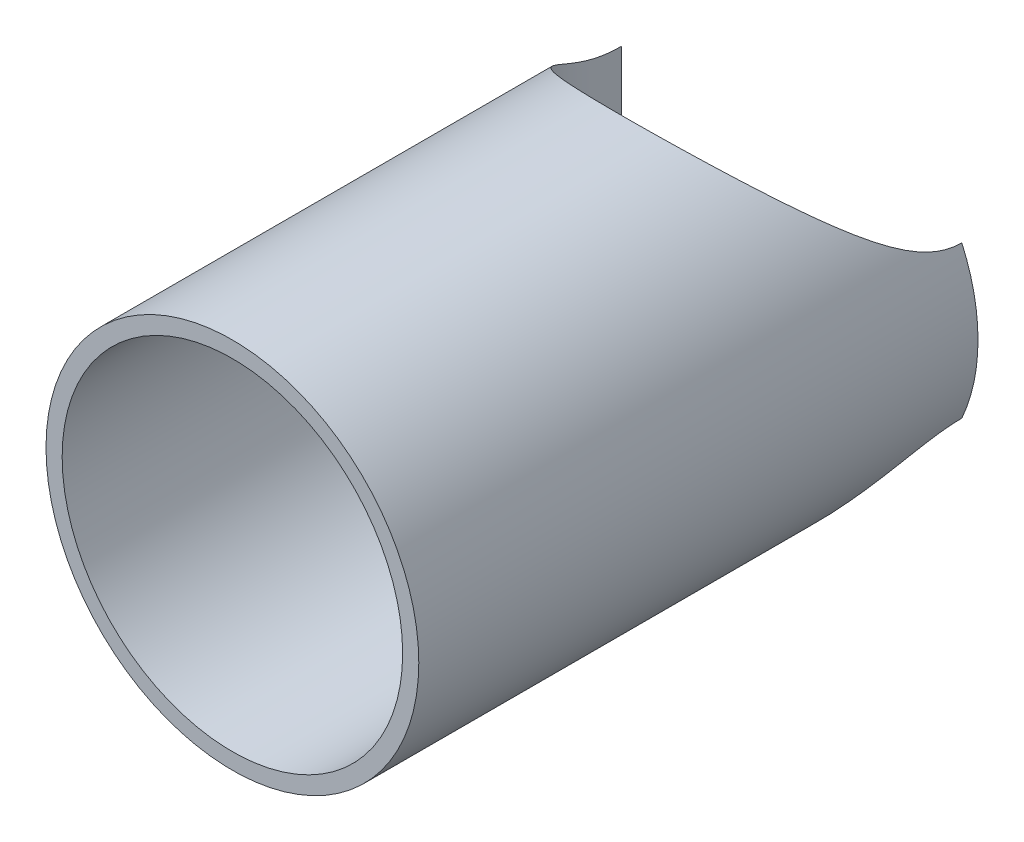
ISO-10303-21;
HEADER;
FILE_DESCRIPTION(('STEP AP214'),'2;1');
FILE_NAME('part.step','',(''),(''),'','','');
FILE_SCHEMA(('AUTOMOTIVE_DESIGN { 1 0 10303 214 1 1 1 1 }'));
ENDSEC;
DATA;
#1=APPLICATION_CONTEXT('core data for automotive mechanical design processes');
#2=APPLICATION_PROTOCOL_DEFINITION('international standard','automotive_design',2000,#1);
#3=PRODUCT_CONTEXT('',#1,'mechanical');
#4=PRODUCT('Part','Part','',(#3));
#5=PRODUCT_RELATED_PRODUCT_CATEGORY('part','',(#4));
#6=PRODUCT_DEFINITION_FORMATION('','',#4);
#7=PRODUCT_DEFINITION_CONTEXT('part definition',#1,'design');
#8=PRODUCT_DEFINITION('design','',#6,#7);
#9=PRODUCT_DEFINITION_SHAPE('','',#8);
#10=(LENGTH_UNIT() NAMED_UNIT(*) SI_UNIT(.MILLI.,.METRE.));
#11=(NAMED_UNIT(*) PLANE_ANGLE_UNIT() SI_UNIT($,.RADIAN.));
#12=(NAMED_UNIT(*) SI_UNIT($,.STERADIAN.) SOLID_ANGLE_UNIT());
#13=UNCERTAINTY_MEASURE_WITH_UNIT(LENGTH_MEASURE(1.E-05),#10,'distance_accuracy_value','');
#14=(GEOMETRIC_REPRESENTATION_CONTEXT(3) GLOBAL_UNCERTAINTY_ASSIGNED_CONTEXT((#13)) GLOBAL_UNIT_ASSIGNED_CONTEXT((#10,
#11,#12)) REPRESENTATION_CONTEXT('',''));
#15=CARTESIAN_POINT('',(0.,0.,0.));
#16=DIRECTION('',(0.,0.,1.));
#17=DIRECTION('',(1.,0.,0.));
#18=AXIS2_PLACEMENT_3D('',#15,#16,#17);
#19=CARTESIAN_POINT('',(0.,0.,0.));
#20=DIRECTION('',(0.,0.,1.));
#21=DIRECTION('',(1.,0.,0.));
#22=AXIS2_PLACEMENT_3D('',#19,#20,#21);
#23=CYLINDRICAL_SURFACE('',#22,17.399);
#24=CARTESIAN_POINT('',(0.,0.,57.15));
#25=DIRECTION('',(0.,0.,1.));
#26=DIRECTION('',(1.,0.,0.));
#27=AXIS2_PLACEMENT_3D('',#24,#25,#26);
#28=CIRCLE('',#27,17.399);
#29=CARTESIAN_POINT('',(17.399,0.,57.15));
#30=VERTEX_POINT('',#29);
#31=EDGE_CURVE('E63',#30,#30,#28,.T.);
#32=ORIENTED_EDGE('',*,*,#31,.T.);
#33=EDGE_LOOP('',(#32));
#34=FACE_BOUND('',#33,.T.);
#35=CARTESIAN_POINT('',(0.,0.,0.));
#36=DIRECTION('',(0.,0.707106781186547,0.707106781186547));
#37=DIRECTION('',(0.,-0.707106781186547,0.707106781186547));
#38=AXIS2_PLACEMENT_3D('',#35,#36,#37);
#39=ELLIPSE('',#38,24.6059017717295,17.399);
#40=CARTESIAN_POINT('',(17.399,0.,0.));
#41=VERTEX_POINT('',#40);
#42=CARTESIAN_POINT('',(-17.399,0.,0.));
#43=VERTEX_POINT('',#42);
#44=EDGE_CURVE('E66',#41,#43,#39,.F.);
#45=ORIENTED_EDGE('',*,*,#44,.T.);
#46=CARTESIAN_POINT('',(-17.399,0.,0.));
#47=CARTESIAN_POINT('',(-17.3990011308637,0.331328994876934,0.331288499333328));
#48=CARTESIAN_POINT('',(-17.3895359806154,0.662777773920171,0.662452537319887));
#49=CARTESIAN_POINT('',(-17.354182890235,1.28061881234766,1.27984220889783));
#50=CARTESIAN_POINT('',(-17.3306707170981,1.56708522240724,1.56613126718147));
#51=CARTESIAN_POINT('',(-17.2741593933146,2.09467960268162,2.09380128410229));
#52=CARTESIAN_POINT('',(-17.2431973119339,2.3359482483264,2.33526043811018));
#53=CARTESIAN_POINT('',(-17.177679009918,2.77346193358048,2.77318291892275));
#54=CARTESIAN_POINT('',(-17.1448260231435,2.96984141021149,2.9697691630006));
#55=CARTESIAN_POINT('',(-17.053195396441,3.46498957987105,3.46509972389215));
#56=CARTESIAN_POINT('',(-16.98985851291,3.7634328586052,3.76334049026124));
#57=CARTESIAN_POINT('',(-16.8511806994521,4.34120611378339,4.34086899698309));
#58=CARTESIAN_POINT('',(-16.7767389829828,4.62064871339774,4.62026081720836));
#59=CARTESIAN_POINT('',(-16.618357658026,5.16038592403001,5.16002415026487));
#60=CARTESIAN_POINT('',(-16.5352733410015,5.42080962241243,5.42051715790506));
#61=CARTESIAN_POINT('',(-16.3619682824427,5.9225854699662,5.92246621840776));
#62=CARTESIAN_POINT('',(-16.2725596410971,6.16407928160144,6.16406139907093));
#63=CARTESIAN_POINT('',(-16.0648641936773,6.68870400423923,6.68872514664784));
#64=CARTESIAN_POINT('',(-15.9442842191765,6.97140000285117,6.97132558864669));
#65=CARTESIAN_POINT('',(-15.692090264551,7.52138357655295,7.52117234296158));
#66=CARTESIAN_POINT('',(-15.5611400425067,7.7888244237628,7.78856984279287));
#67=CARTESIAN_POINT('',(-15.2898825899193,8.30823658158246,8.30799045094507));
#68=CARTESIAN_POINT('',(-15.1502208515848,8.56037821331848,8.56017986480889));
#69=CARTESIAN_POINT('',(-14.8631475667476,9.04924098266211,9.04916207079481));
#70=CARTESIAN_POINT('',(-14.716363574788,9.28614688008941,9.28613845727461));
#71=CARTESIAN_POINT('',(-14.3951906833458,9.77740171343267,9.77741091638758));
#72=CARTESIAN_POINT('',(-14.2195041976432,10.0313338750929,10.0312781848761));
#73=CARTESIAN_POINT('',(-13.8583245878214,10.524357664459,10.5242054716175));
#74=CARTESIAN_POINT('',(-13.6733966582859,10.7636567269108,10.7634718304358));
#75=CARTESIAN_POINT('',(-13.2950314709039,11.2273598541476,11.2271796122021));
#76=CARTESIAN_POINT('',(-13.1021449124595,11.4519894946947,11.4518441165275));
#77=CARTESIAN_POINT('',(-12.7091177143155,11.8863833716026,11.8863260772742));
#78=CARTESIAN_POINT('',(-12.5095124093792,12.0963898718007,12.0963850678313));
#79=CARTESIAN_POINT('',(-12.0888476825434,12.5170535611354,12.5170585405004));
#80=CARTESIAN_POINT('',(-11.867271036784,12.7274545640097,12.7274132906681));
#81=CARTESIAN_POINT('',(-11.4161369932612,13.1334001596869,13.1332890696922));
#82=CARTESIAN_POINT('',(-11.1870452916996,13.3292035388693,13.3290682211509));
#83=CARTESIAN_POINT('',(-10.7219396261346,13.7059083660326,13.7057759704559));
#84=CARTESIAN_POINT('',(-10.4863707163118,13.8870849012415,13.8869780619076));
#85=CARTESIAN_POINT('',(-10.0093409437893,14.2345561896179,14.2345143840518));
#86=CARTESIAN_POINT('',(-9.76830223262916,14.4011404127409,14.4011376187175));
#87=CARTESIAN_POINT('',(-9.27469282491392,14.7238513521684,14.7238541327518));
#88=CARTESIAN_POINT('',(-9.02218317762893,14.8800245173527,14.8799942085943));
#89=CARTESIAN_POINT('',(-8.51143320550011,15.17780577695,15.1777255632559));
#90=CARTESIAN_POINT('',(-8.25351231100356,15.3196868999698,15.3195894701364));
#91=CARTESIAN_POINT('',(-7.86055793692457,15.522822723787,15.5227259132659));
#92=CARTESIAN_POINT('',(-7.72987393547371,15.5883224924115,15.5882301268393));
#93=CARTESIAN_POINT('',(-7.46744079934224,15.7157097134347,15.7156329083403));
#94=CARTESIAN_POINT('',(-7.33572578439618,15.7776322605029,15.7775664862578));
#95=CARTESIAN_POINT('',(-7.0713408526649,15.89786675948,15.8978253102093));
#96=CARTESIAN_POINT('',(-6.93870294731716,15.9562139212813,15.9561857364243));
#97=CARTESIAN_POINT('',(-6.67257484172981,16.0693059665347,16.0692983003262));
#98=CARTESIAN_POINT('',(-6.5391145696896,16.124086000282,16.1240856593634));
#99=CARTESIAN_POINT('',(-6.27314212663758,16.2293820508048,16.2293823833748));
#100=CARTESIAN_POINT('',(-6.14068677200883,16.2799696359967,16.2799636546496));
#101=CARTESIAN_POINT('',(-5.8748684496391,16.3777589819801,16.3777371159858));
#102=CARTESIAN_POINT('',(-5.74152553126073,16.4249879659121,16.4249565601746));
#103=CARTESIAN_POINT('',(-5.47402115877983,16.5160550971116,16.5160062636609));
#104=CARTESIAN_POINT('',(-5.33987788890363,16.5599199494832,16.5598632139616));
#105=CARTESIAN_POINT('',(-5.0708615482511,16.6442561413558,16.6441886913204));
#106=CARTESIAN_POINT('',(-4.93600480608221,16.6847535344294,16.6846832285512));
#107=CARTESIAN_POINT('',(-4.66564969995905,16.7623545036231,16.762284561608));
#108=CARTESIAN_POINT('',(-4.53016583341798,16.7994833464645,16.7994165741733));
#109=CARTESIAN_POINT('',(-4.25864402464156,16.8703492415508,16.8702936771996));
#110=CARTESIAN_POINT('',(-4.1226187875179,16.9041106384636,16.9040630739031));
#111=CARTESIAN_POINT('',(-3.85010126264908,16.9682459387044,16.9682159832133));
#112=CARTESIAN_POINT('',(-3.7136199403314,16.9986431310521,16.9986227724491));
#113=CARTESIAN_POINT('',(-3.44027598403682,17.0560566629996,17.0560512035975));
#114=CARTESIAN_POINT('',(-3.30342264906392,17.0830951044979,17.0830949768953));
#115=CARTESIAN_POINT('',(-3.03546364409865,17.1326815825355,17.132681703699));
#116=CARTESIAN_POINT('',(-2.90441642762355,17.1553873643714,17.1553829144864));
#117=CARTESIAN_POINT('',(-2.64192370290757,17.1977626436417,17.1977466393632));
#118=CARTESIAN_POINT('',(-2.51048219796085,17.2174445285761,17.2174215511955));
#119=CARTESIAN_POINT('',(-2.24727207444598,17.2537692378582,17.2537335254227));
#120=CARTESIAN_POINT('',(-2.11550651579715,17.2704231484942,17.2703816696755));
#121=CARTESIAN_POINT('',(-1.85171901959868,17.3006908882117,17.3006415630633));
#122=CARTESIAN_POINT('',(-1.71969931056298,17.3143144308917,17.3142630138654));
#123=CARTESIAN_POINT('',(-1.45547409463277,17.3385220761164,17.3384708920411));
#124=CARTESIAN_POINT('',(-1.323270104293,17.3491144575098,17.3490655860987));
#125=CARTESIAN_POINT('',(-1.05874661674972,17.3672620877226,17.36722140925));
#126=CARTESIAN_POINT('',(-0.926428051590948,17.3748241285407,17.3747893222893));
#127=CARTESIAN_POINT('',(-0.661745401360201,17.3869150272733,17.3868930938386));
#128=CARTESIAN_POINT('',(-0.529381797623768,17.3914491490759,17.3914342142522));
#129=CARTESIAN_POINT('',(-0.264678682179303,17.3974897824417,17.3974858865217));
#130=CARTESIAN_POINT('',(-0.13233933998178,17.3989999999915,17.3990001479815));
#131=CARTESIAN_POINT('',(0.132343102844987,17.3990000000085,17.3989998520142));
#132=CARTESIAN_POINT('',(0.264686203474104,17.3974896965932,17.3974852084662));
#133=CARTESIAN_POINT('',(0.529395756251864,17.3914487446318,17.3914329206721));
#134=CARTESIAN_POINT('',(0.661762040001853,17.3869144144388,17.3868915915467));
#135=CARTESIAN_POINT('',(0.92644896772938,17.3748230255675,17.3747874520819));
#136=CARTESIAN_POINT('',(1.0587691326032,17.3672607273787,17.3672194044208));
#137=CARTESIAN_POINT('',(1.32329473756529,17.3491125827395,17.3490633877189));
#138=CARTESIAN_POINT('',(1.4554992489517,17.3385199686424,17.3384686592246));
#139=CARTESIAN_POINT('',(1.71972442920772,17.3143119319016,17.3142607827641));
#140=CARTESIAN_POINT('',(1.85174358595603,17.3006882546736,17.300639392332));
#141=CARTESIAN_POINT('',(2.11552890590344,17.2704203934741,17.270379685527));
#142=CARTESIAN_POINT('',(2.24729284607558,17.2537665200233,17.2537316913085));
#143=CARTESIAN_POINT('',(2.51049867631982,17.2174421050912,17.2174201090593));
#144=CARTESIAN_POINT('',(2.64193751299076,17.1977605012373,17.1977454625961));
#145=CARTESIAN_POINT('',(2.90442384157753,17.1553860801165,17.1553822628499));
#146=CARTESIAN_POINT('',(3.03546733761075,17.1326808990283,17.1326813342488));
#147=CARTESIAN_POINT('',(3.30342657291425,17.0830943783941,17.0830939200179));
#148=CARTESIAN_POINT('',(3.44028379405071,17.0560551202761,17.0560490037316));
#149=CARTESIAN_POINT('',(3.71363437804045,16.9986400001387,16.9986186527062));
#150=CARTESIAN_POINT('',(3.85011845296442,16.9682420615591,16.9682111142236));
#151=CARTESIAN_POINT('',(4.12264033144995,16.904105398461,16.9040569697761));
#152=CARTESIAN_POINT('',(4.25866718163659,16.870343410098,16.8702871133423));
#153=CARTESIAN_POINT('',(4.53019108564152,16.7994765416222,16.7994093825609));
#154=CARTESIAN_POINT('',(4.66567544748057,16.76234734177,16.7622772275004));
#155=CARTESIAN_POINT('',(4.9360304323311,16.6847459483422,16.6846758961775));
#156=CARTESIAN_POINT('',(5.0708865720189,16.6442485126905,16.6441815277317));
#157=CARTESIAN_POINT('',(5.33990061783175,16.55991260583,16.5598566711235));
#158=CARTESIAN_POINT('',(5.47404221030653,16.5160481053818,16.5160001963081));
#159=CARTESIAN_POINT('',(5.74154217437029,16.4249821235549,16.4249517522341));
#160=CARTESIAN_POINT('',(5.87488237757024,16.3777539610281,16.377733114662));
#161=CARTESIAN_POINT('',(6.14069421589947,16.2799667936959,16.2799614823963));
#162=CARTESIAN_POINT('',(6.27314581793012,16.2293805894571,16.2293812542933));
#163=CARTESIAN_POINT('',(6.53911843369672,16.1240844705558,16.1240837889914));
#164=CARTESIAN_POINT('',(6.6725825007365,16.0693028234905,16.0692944809927));
#165=CARTESIAN_POINT('',(6.93871704145251,15.9562078188688,15.956178611685));
#166=CARTESIAN_POINT('',(7.07135760783225,15.8978593336773,15.8978168557831));
#167=CARTESIAN_POINT('',(7.33574670377706,15.7776225505781,15.7775558713312));
#168=CARTESIAN_POINT('',(7.46746324313444,15.7156990653493,15.7156214868573));
#169=CARTESIAN_POINT('',(7.72989830986156,15.5883104113434,15.5882176122188));
#170=CARTESIAN_POINT('',(7.86058273950878,15.5228101701612,15.5227131352272));
#171=CARTESIAN_POINT('',(8.25353521535424,15.3196745134129,15.3195775255319));
#172=CARTESIAN_POINT('',(8.51145389332373,15.177794126177,15.1777148432391));
#173=CARTESIAN_POINT('',(9.02219526517278,14.8800170481196,14.8799876943916));
#174=CARTESIAN_POINT('',(9.27469871505861,14.7238475016823,14.7238507467716));
#175=CARTESIAN_POINT('',(9.76830834571355,14.4011364157789,14.4011331548459));
#176=CARTESIAN_POINT('',(10.0093528614838,14.2345479589407,14.2345052423058));
#177=CARTESIAN_POINT('',(10.4863899241457,13.8870704451552,13.8869626730327));
#178=CARTESIAN_POINT('',(10.7219605410667,13.7058920566566,13.7057591792237));
#179=CARTESIAN_POINT('',(11.1870656131564,13.3291864289314,13.3290515004162));
#180=CARTESIAN_POINT('',(11.4161552377849,13.1333842417648,13.1332739587925));
#181=CARTESIAN_POINT('',(11.8672815432061,12.7274445947568,12.7274041499341));
#182=CARTESIAN_POINT('',(12.088852755031,12.5170484889207,12.517053873492));
#183=CARTESIAN_POINT('',(12.5095175578729,12.0963847230684,12.0963795279133));
#184=CARTESIAN_POINT('',(12.7091276713605,11.8863729021756,11.8863148376935));
#185=CARTESIAN_POINT('',(13.1021607290177,11.4519714571547,11.4518252711373));
#186=CARTESIAN_POINT('',(13.2950485751887,11.2273396628897,11.2271589823143));
#187=CARTESIAN_POINT('',(13.6734130173025,10.7636358783721,10.763451251504));
#188=CARTESIAN_POINT('',(13.858339153512,10.524338411798,10.5241868247927));
#189=CARTESIAN_POINT('',(14.2195124215554,10.031321996054,10.0312669453136));
#190=CARTESIAN_POINT('',(14.3951946051437,9.7773957150844,9.77740523066256));
#191=CARTESIAN_POINT('',(14.7163674472392,9.28614095665167,9.28613224729147));
#192=CARTESIAN_POINT('',(14.8631549792588,9.04922902525791,9.04914954618527));
#193=CARTESIAN_POINT('',(15.1502323847489,8.56035787657117,8.56015891678717));
#194=CARTESIAN_POINT('',(15.2898949291603,8.30821395404564,8.3079674730765));
#195=CARTESIAN_POINT('',(15.5611515555253,7.78880133314123,7.78854689744975));
#196=CARTESIAN_POINT('',(15.6921003797321,7.52136237689545,7.52115152000875));
#197=CARTESIAN_POINT('',(15.944289741381,6.97138706353182,6.97131306349413));
#198=CARTESIAN_POINT('',(16.0648667682493,6.68869750139016,6.68871884448677));
#199=CARTESIAN_POINT('',(16.2725620824778,6.16407311454511,6.16405506139386));
#200=CARTESIAN_POINT('',(16.3619728725739,5.92257307722494,5.92245348547243));
#201=CARTESIAN_POINT('',(16.535280221155,5.42078874277266,5.42049589512133));
#202=CARTESIAN_POINT('',(16.618364872423,5.16036280687721,5.16000079710574));
#203=CARTESIAN_POINT('',(16.7767453827511,4.62062534005807,4.62023748154183));
#204=CARTESIAN_POINT('',(16.8511861632785,4.34118475559803,4.34084779902526));
#205=CARTESIAN_POINT('',(16.9898612578486,3.76341993156685,3.7633277559053));
#206=CARTESIAN_POINT('',(17.053196594646,3.464983105639,3.46509333680204));
#207=CARTESIAN_POINT('',(17.1448268330524,2.96983703330779,2.96976472575839));
#208=CARTESIAN_POINT('',(17.1776804769336,2.77345316738225,2.7731740281345));
#209=CARTESIAN_POINT('',(17.2431993186325,2.33593358655074,2.33524560548374));
#210=CARTESIAN_POINT('',(17.2741613748475,2.09466343246891,2.09378498081143));
#211=CARTESIAN_POINT('',(17.3306721606797,1.567068988297,1.56611497024853));
#212=CARTESIAN_POINT('',(17.3541839563502,1.28060403473809,1.27982739369487));
#213=CARTESIAN_POINT('',(17.3895362343148,0.66276888754068,0.662443645442081));
#214=CARTESIAN_POINT('',(17.3990011304629,0.331324551349306,0.331284053321532));
#215=CARTESIAN_POINT('',(17.399,0.,0.));
#216=B_SPLINE_CURVE_WITH_KNOTS('',3,(#46,#47,#48,#49,#50,#51,#52,#53,#54,#55,#56,#57,#58,#59,
#60,#61,#62,#63,#64,#65,#66,#67,#68,#69,#70,#71,#72,#73,#74,#75,#76,#77,#78,#79,#80,#81,#82,#83,
#84,#85,#86,#87,#88,#89,#90,#91,#92,#93,#94,#95,#96,#97,#98,#99,#100,#101,#102,#103,#104,#105,
#106,#107,#108,#109,#110,#111,#112,#113,#114,#115,#116,#117,#118,#119,#120,#121,#122,#123,#124,
#125,#126,#127,#128,#129,#130,#131,#132,#133,#134,#135,#136,#137,#138,#139,#140,#141,#142,#143,
#144,#145,#146,#147,#148,#149,#150,#151,#152,#153,#154,#155,#156,#157,#158,#159,#160,#161,#162,
#163,#164,#165,#166,#167,#168,#169,#170,#171,#172,#173,#174,#175,#176,#177,#178,#179,#180,#181,
#182,#183,#184,#185,#186,#187,#188,#189,#190,#191,#192,#193,#194,#195,#196,#197,#198,#199,#200,
#201,#202,#203,#204,#205,#206,#207,#208,#209,#210,#211,#212,#213,#214,#215),.UNSPECIFIED.,.F.,
.F.,(4,2,2,2,2,2,2,2,2,2,2,2,2,2,2,2,2,2,2,2,2,2,2,2,2,2,2,2,2,2,2,2,2,2,2,2,2,2,2,2,2,2,2,2,2,
2,2,2,2,2,2,2,2,2,2,2,2,2,2,2,2,2,2,2,2,2,2,2,2,2,2,2,2,2,2,2,2,2,2,2,2,2,2,2,4),(0.,
1.40551630381485,2.62231117864685,3.65037899432671,4.48971758438186,5.76932583809447,
6.97538493320223,8.1079443879443,9.16706431128381,10.4192554462774,11.619589128759,
12.7682494574324,13.8654466039762,15.0642686263511,16.2207668838282,17.3353827550133,
18.4086093128293,19.521019988392,20.5986721998633,21.6423941807822,22.6530975875912,
23.6589392392227,24.6386430781612,25.1191397415278,25.5935874776259,26.0621612660575,
26.5250427479471,26.9765889886385,27.4239154601621,27.867213682969,28.3066804441006,
28.7425177205186,29.1749325751135,29.6041370240872,30.0303478746665,30.4350509025218,
30.8380491089705,31.239540728672,31.6397262351866,32.0388080704063,32.4369903595961,
32.8344786138765,33.23147942219,33.6284915186038,34.0259878478789,34.42417498677,
34.8232584392863,35.2234423286034,35.6249290994546,36.0279192330442,36.4326109763196,
36.8588341719642,37.288047451863,37.7204676100571,38.1563066551372,38.5957716476569,
39.0390645671939,39.486382208024,39.9379161021075,40.4008112215822,40.8693947623903,
41.3438483542563,41.8243469702462,42.8040430011725,43.8098612581141,44.8205903103499,
45.8643208478344,46.9419645023942,48.0543495253715,49.1276035107911,50.2422285290847,
51.3987176391151,52.5975122283297,53.6947376105801,54.8434073531732,56.043731621553,
57.2958945179332,58.3550419584849,59.487610586171,60.6936605083512,61.9732412444898,
62.8125986887249,63.8406727889924,65.0574613794757,66.4629588311663),.UNSPECIFIED.);
#217=EDGE_CURVE('E55',#43,#41,#216,.T.);
#218=ORIENTED_EDGE('',*,*,#217,.T.);
#219=EDGE_LOOP('',(#45,#218));
#220=FACE_BOUND('',#219,.T.);
#221=ADVANCED_FACE('F16',(#34,#220),#23,.F.);
#222=CARTESIAN_POINT('',(0.,0.,57.15));
#223=DIRECTION('',(0.,0.,-1.));
#224=DIRECTION('',(-1.,0.,0.));
#225=AXIS2_PLACEMENT_3D('',#222,#223,#224);
#226=PLANE('',#225);
#227=ORIENTED_EDGE('',*,*,#31,.F.);
#228=EDGE_LOOP('',(#227));
#229=FACE_BOUND('',#228,.T.);
#230=CARTESIAN_POINT('',(0.,0.,57.15));
#231=DIRECTION('',(0.,0.,1.));
#232=DIRECTION('',(1.,0.,0.));
#233=AXIS2_PLACEMENT_3D('',#230,#231,#232);
#234=CIRCLE('',#233,19.05);
#235=CARTESIAN_POINT('',(19.05,0.,57.15));
#236=VERTEX_POINT('',#235);
#237=EDGE_CURVE('E86',#236,#236,#234,.F.);
#238=ORIENTED_EDGE('',*,*,#237,.F.);
#239=EDGE_LOOP('',(#238));
#240=FACE_BOUND('',#239,.T.);
#241=ADVANCED_FACE('F121',(#229,#240),#226,.F.);
#242=CARTESIAN_POINT('',(0.,0.,0.));
#243=DIRECTION('',(0.,1.,0.));
#244=DIRECTION('',(0.,0.,1.));
#245=AXIS2_PLACEMENT_3D('',#242,#243,#244);
#246=CYLINDRICAL_SURFACE('',#245,17.399);
#247=ORIENTED_EDGE('',*,*,#217,.F.);
#248=DIRECTION('',(0.,1.,0.));
#249=VECTOR('',#248,1.);
#250=CARTESIAN_POINT('',(-17.399,0.,0.));
#251=LINE('',#250,#249);
#252=CARTESIAN_POINT('',(-17.399,7.75740285147033,0.));
#253=VERTEX_POINT('',#252);
#254=EDGE_CURVE('E60',#253,#43,#251,.F.);
#255=ORIENTED_EDGE('',*,*,#254,.F.);
#256=CARTESIAN_POINT('',(17.399,7.75740285147032,0.));
#257=CARTESIAN_POINT('',(17.3990027926557,7.75738928067626,0.126619411653411));
#258=CARTESIAN_POINT('',(17.3976172953479,7.76050481767002,0.25321342214225));
#259=CARTESIAN_POINT('',(17.3920993093259,7.7728663106787,0.506011561056936));
#260=CARTESIAN_POINT('',(17.3879674951789,7.78211076127069,0.632215777580589));
#261=CARTESIAN_POINT('',(17.3715310393773,7.81876986710136,1.00902330778525));
#262=CARTESIAN_POINT('',(17.3551849725285,7.85511193712096,1.25863541656879));
#263=CARTESIAN_POINT('',(17.3126787054344,7.94834436267528,1.74803233786395));
#264=CARTESIAN_POINT('',(17.2867118539878,8.00482912325347,1.98791378893045));
#265=CARTESIAN_POINT('',(17.2256220476168,8.13545614886296,2.46176178605719));
#266=CARTESIAN_POINT('',(17.1904915826852,8.20961289257842,2.69572330712606));
#267=CARTESIAN_POINT('',(17.0914704002142,8.41444164911149,3.27608545997221));
#268=CARTESIAN_POINT('',(17.0220928683165,8.55453145327276,3.6182148201961));
#269=CARTESIAN_POINT('',(16.8659507450822,8.85840913920196,4.2875618159471));
#270=CARTESIAN_POINT('',(16.7791763237468,9.02221040436538,4.6147708919803));
#271=CARTESIAN_POINT('',(16.5885907607409,9.36806215757178,5.25908025866418));
#272=CARTESIAN_POINT('',(16.4846028375362,9.55029344833314,5.57602990071133));
#273=CARTESIAN_POINT('',(16.2611162606568,9.92604811707565,6.19761374754541));
#274=CARTESIAN_POINT('',(16.1416117153161,10.1195757688457,6.50224321644266));
#275=CARTESIAN_POINT('',(15.9012328343761,10.4927199440383,7.0682446326165));
#276=CARTESIAN_POINT('',(15.7818795075659,10.6716028930283,7.33075234639334));
#277=CARTESIAN_POINT('',(15.531375280231,11.0330066315397,7.84755054304734));
#278=CARTESIAN_POINT('',(15.4002228366692,11.2155278944272,8.10183994524194));
#279=CARTESIAN_POINT('',(15.1261173325553,11.5825543909568,8.60275103720113));
#280=CARTESIAN_POINT('',(14.9831580377589,11.7670606274058,8.84936858024162));
#281=CARTESIAN_POINT('',(14.6854749405307,12.1365419716062,9.33504840785215));
#282=CARTESIAN_POINT('',(14.5307500246226,12.3215171221294,9.57410997430043));
#283=CARTESIAN_POINT('',(14.0499414824725,12.873976753931,10.2784757466186));
#284=CARTESIAN_POINT('',(13.706221982577,13.2403569500405,10.7327911450247));
#285=CARTESIAN_POINT('',(12.9709988366539,13.9614056628348,11.6105902831832));
#286=CARTESIAN_POINT('',(12.5795204493307,14.3160802453506,12.0340901330639));
#287=CARTESIAN_POINT('',(11.8513027830295,14.9202493412787,12.7460780346227));
#288=CARTESIAN_POINT('',(11.5252152004648,15.17393857843,13.0419213680792));
#289=CARTESIAN_POINT('',(10.8451357651757,15.6672254345686,13.6126880208168));
#290=CARTESIAN_POINT('',(10.4911442114866,15.9068232045201,13.8876115642246));
#291=CARTESIAN_POINT('',(9.75564643242529,16.3682053590736,14.4137713143204));
#292=CARTESIAN_POINT('',(9.37416774185506,16.5900071123435,14.6650306596365));
#293=CARTESIAN_POINT('',(8.58390774378863,17.0123369264844,15.1411487148883));
#294=CARTESIAN_POINT('',(8.17513251731962,17.2128696999897,15.3660132743823));
#295=CARTESIAN_POINT('',(7.41609675759785,17.5510787980119,15.7438449488538));
#296=CARTESIAN_POINT('',(7.07052907343836,17.6932976749746,15.9021892450144));
#297=CARTESIAN_POINT('',(6.36382451687043,17.9595864108884,16.1979501260028));
#298=CARTESIAN_POINT('',(6.00269106933712,18.0836602360993,16.3353712846128));
#299=CARTESIAN_POINT('',(5.26647789377182,18.3116118596446,16.5873660705376));
#300=CARTESIAN_POINT('',(4.89140366751785,18.4154975265765,16.7019485999545));
#301=CARTESIAN_POINT('',(4.12923028647434,18.6012306252741,16.9065171053999));
#302=CARTESIAN_POINT('',(3.74213100127713,18.6830778179467,16.9965028145804));
#303=CARTESIAN_POINT('',(2.95593537190506,18.8235337773239,17.1507769807365));
#304=CARTESIAN_POINT('',(2.55677683000922,18.8819860313285,17.2148923872178));
#305=CARTESIAN_POINT('',(1.75207798329656,18.9735785556383,17.3153056168189));
#306=CARTESIAN_POINT('',(1.34653766138734,19.0067187581382,17.3516033654214));
#307=CARTESIAN_POINT('',(0.532740871466215,19.0469054092445,17.3956140232931));
#308=CARTESIAN_POINT('',(0.124485289769621,19.0539599906146,17.4033358417348));
#309=CARTESIAN_POINT('',(-0.691145635542919,19.0418258138202,17.3900500247943));
#310=CARTESIAN_POINT('',(-1.09852104488593,19.02263908821,17.3690446145166));
#311=CARTESIAN_POINT('',(-1.8665074066449,18.9618364386318,17.3024305274246));
#312=CARTESIAN_POINT('',(-2.22756908470296,18.9227652631555,17.2596128163397));
#313=CARTESIAN_POINT('',(-2.94361664813323,18.8246695916722,17.1520079260685));
#314=CARTESIAN_POINT('',(-3.29860304440391,18.7656467822389,17.0872226038712));
#315=CARTESIAN_POINT('',(-4.0003834177903,18.6286682489913,16.9366748894927));
#316=CARTESIAN_POINT('',(-4.34717668373009,18.5507108882069,16.8509106835957));
#317=CARTESIAN_POINT('',(-5.03073264287061,18.3771216594109,16.65961931318));
#318=CARTESIAN_POINT('',(-5.36749474073485,18.2814887447958,16.5540909783843));
#319=CARTESIAN_POINT('',(-6.0450883689476,18.0690712727941,16.319211609248));
#320=CARTESIAN_POINT('',(-6.38536566225004,17.9515031398445,16.1889732182396));
#321=CARTESIAN_POINT('',(-7.05200979717746,17.7002421296737,15.9099012910429));
#322=CARTESIAN_POINT('',(-7.37837661185776,17.5665492212207,15.7610677188377));
#323=CARTESIAN_POINT('',(-8.01637955747606,17.2847274052077,15.4463398391999));
#324=CARTESIAN_POINT('',(-8.328012631591,17.1365955213283,15.2804420139058));
#325=CARTESIAN_POINT('',(-8.935938653738,16.8275912941987,14.9330779736276));
#326=CARTESIAN_POINT('',(-9.23222831724048,16.6667162415391,14.751608447154));
#327=CARTESIAN_POINT('',(-9.9610807011477,16.24616265681,14.2751141336036));
#328=CARTESIAN_POINT('',(-10.3832304302347,15.9790705087056,13.9706188807904));
#329=CARTESIAN_POINT('',(-11.1906483352997,15.4243967388524,13.3326512383542));
#330=CARTESIAN_POINT('',(-11.5758996118658,15.1368058328948,12.9991657033674));
#331=CARTESIAN_POINT('',(-12.3107246973626,14.5454983316236,12.3055766392129));
#332=CARTESIAN_POINT('',(-12.6601983724747,14.2417399093146,11.9454030182208));
#333=CARTESIAN_POINT('',(-13.3228256699069,13.6238744147983,11.2015895641249));
#334=CARTESIAN_POINT('',(-13.6359864105728,13.3097693863682,10.8179543527437));
#335=CARTESIAN_POINT('',(-14.2338486111263,12.6687294700676,10.0188698517803));
#336=CARTESIAN_POINT('',(-14.517686463156,12.3416676006416,9.60287793519721));
#337=CARTESIAN_POINT('',(-15.0487827113267,11.688186754623,8.74718214020965));
#338=CARTESIAN_POINT('',(-15.2960234328361,11.3617681633013,8.30746694358541));
#339=CARTESIAN_POINT('',(-15.6391176739874,10.8793160856903,7.62936065904868));
#340=CARTESIAN_POINT('',(-15.7488029782036,10.719778727444,7.40036468575159));
#341=CARTESIAN_POINT('',(-15.9589029321097,10.4044108647402,6.93568044188579));
#342=CARTESIAN_POINT('',(-16.0593187405627,10.2485798987662,6.69999301263361));
#343=CARTESIAN_POINT('',(-16.25064002581,9.94242216980458,6.22159236078593));
#344=CARTESIAN_POINT('',(-16.3415534376162,9.79209088359618,5.9788852198135));
#345=CARTESIAN_POINT('',(-16.5136633013956,9.49896230357114,5.48564865833395));
#346=CARTESIAN_POINT('',(-16.5948621460068,9.35616315949889,5.23512118317326));
#347=CARTESIAN_POINT('',(-16.7399044598348,9.0938654480011,4.74960595279279));
#348=CARTESIAN_POINT('',(-16.8046633839798,8.97344114073015,4.51539494834857));
#349=CARTESIAN_POINT('',(-16.9253972886873,8.74358476749362,4.03935876063696));
#350=CARTESIAN_POINT('',(-16.981371807116,8.63415327995198,3.79753317758154));
#351=CARTESIAN_POINT('',(-17.0835577011958,8.43015385639926,3.30749209621929));
#352=CARTESIAN_POINT('',(-17.1298288043977,8.33549596631582,3.05932691299979));
#353=CARTESIAN_POINT('',(-17.2122316312634,8.16398538994439,2.5552691644349));
#354=CARTESIAN_POINT('',(-17.2483680118588,8.08712452871587,2.29938020825192));
#355=CARTESIAN_POINT('',(-17.2984619179858,7.97921413520514,1.87510757973661));
#356=CARTESIAN_POINT('',(-17.3157056836072,7.94167042397934,1.70875077851932));
#357=CARTESIAN_POINT('',(-17.3454986249528,7.87638621901043,1.37373521286451));
#358=CARTESIAN_POINT('',(-17.35804919276,7.84864281846194,1.20507714643116));
#359=CARTESIAN_POINT('',(-17.3783689967595,7.80355358549084,0.864236195915917));
#360=CARTESIAN_POINT('',(-17.386085725966,7.78632198711612,0.692034904492624));
#361=CARTESIAN_POINT('',(-17.3964114605965,7.76320820627028,0.346566926126348));
#362=CARTESIAN_POINT('',(-17.3990157927525,7.75733640792047,0.173299409508219));
#363=CARTESIAN_POINT('',(-17.399,7.75740285147036,0.));
#364=B_SPLINE_CURVE_WITH_KNOTS('',3,(#256,#257,#258,#259,#260,#261,#262,#263,#264,#265,#266,
#267,#268,#269,#270,#271,#272,#273,#274,#275,#276,#277,#278,#279,#280,#281,#282,#283,#284,#285,
#286,#287,#288,#289,#290,#291,#292,#293,#294,#295,#296,#297,#298,#299,#300,#301,#302,#303,#304,
#305,#306,#307,#308,#309,#310,#311,#312,#313,#314,#315,#316,#317,#318,#319,#320,#321,#322,#323,
#324,#325,#326,#327,#328,#329,#330,#331,#332,#333,#334,#335,#336,#337,#338,#339,#340,#341,#342,
#343,#344,#345,#346,#347,#348,#349,#350,#351,#352,#353,#354,#355,#356,#357,#358,#359,#360,#361,
#362,#363),.UNSPECIFIED.,.F.,.F.,(4,2,2,2,2,2,2,2,2,2,2,2,2,2,2,2,2,2,2,2,2,2,2,2,2,2,2,2,2,2,2,
2,2,2,2,2,2,2,2,2,2,2,2,2,2,2,2,2,2,2,2,2,2,4),(0.,0.379764092853832,0.759434940165907,
1.51634726991587,2.25880724087371,3.00187761458815,4.12835037763911,5.25546144985719,
6.39496160348711,7.53489569789875,8.55259337985784,9.57042434587642,10.5887962249633,
11.6072646010801,13.6367495933949,15.6651658480776,17.1883664070907,18.71155064481,
20.2332297195439,21.754570923617,22.9709961355442,24.187155054878,25.4028390055058,
26.6185361444175,27.8422355786928,29.0659382909752,30.2892594549617,31.5124858703965,
32.6082843336791,33.7039901888642,34.7997908060849,35.8956563285599,37.043090764153,
38.1905274222329,39.3382011047018,40.4861194600479,42.2386035757021,43.991886525206,
45.749949583538,47.5076674278728,49.3075787665061,51.1083565581975,52.0077767250255,
52.9070843042517,53.8056348105302,54.7039635517725,55.5171752742101,56.3304297641097,
57.1385211097759,57.9462405247014,58.4601584642904,58.9739238458356,59.4931773421598,
60.0129052701035),.UNSPECIFIED.);
#365=CARTESIAN_POINT('',(17.399,7.75740285147032,0.));
#366=VERTEX_POINT('',#365);
#367=EDGE_CURVE('E49',#366,#253,#364,.T.);
#368=ORIENTED_EDGE('',*,*,#367,.F.);
#369=DIRECTION('',(0.,1.,0.));
#370=VECTOR('',#369,1.);
#371=CARTESIAN_POINT('',(17.399,0.,0.));
#372=LINE('',#371,#370);
#373=EDGE_CURVE('E62',#41,#366,#372,.T.);
#374=ORIENTED_EDGE('',*,*,#373,.F.);
#375=EDGE_LOOP('',(#247,#255,#368,#374));
#376=FACE_BOUND('',#375,.T.);
#377=ADVANCED_FACE('F58',(#376),#246,.F.);
#378=CARTESIAN_POINT('',(0.,0.,0.));
#379=DIRECTION('',(0.,0.,-1.));
#380=DIRECTION('',(-1.,0.,0.));
#381=AXIS2_PLACEMENT_3D('',#378,#379,#380);
#382=PLANE('',#381);
#383=DIRECTION('',(0.,1.,0.));
#384=VECTOR('',#383,1.);
#385=CARTESIAN_POINT('',(-17.399,0.,0.));
#386=LINE('',#385,#384);
#387=CARTESIAN_POINT('',(-17.399,-7.75740285147033,0.));
#388=VERTEX_POINT('',#387);
#389=EDGE_CURVE('E68',#43,#388,#386,.F.);
#390=ORIENTED_EDGE('',*,*,#389,.T.);
#391=CARTESIAN_POINT('',(0.,0.,0.));
#392=DIRECTION('',(0.,0.,1.));
#393=DIRECTION('',(1.,0.,0.));
#394=AXIS2_PLACEMENT_3D('',#391,#392,#393);
#395=CIRCLE('',#394,19.05);
#396=EDGE_CURVE('E72',#253,#388,#395,.T.);
#397=ORIENTED_EDGE('',*,*,#396,.F.);
#398=ORIENTED_EDGE('',*,*,#254,.T.);
#399=EDGE_LOOP('',(#390,#397,#398));
#400=FACE_BOUND('',#399,.T.);
#401=ADVANCED_FACE('F70',(#400),#382,.T.);
#402=CARTESIAN_POINT('',(0.,0.,0.));
#403=DIRECTION('',(0.,1.,0.));
#404=DIRECTION('',(0.,0.,1.));
#405=AXIS2_PLACEMENT_3D('',#402,#403,#404);
#406=CYLINDRICAL_SURFACE('',#405,17.399);
#407=ORIENTED_EDGE('',*,*,#389,.F.);
#408=ORIENTED_EDGE('',*,*,#44,.F.);
#409=DIRECTION('',(0.,1.,0.));
#410=VECTOR('',#409,1.);
#411=CARTESIAN_POINT('',(17.399,0.,0.));
#412=LINE('',#411,#410);
#413=CARTESIAN_POINT('',(17.399,-7.75740285147033,0.));
#414=VERTEX_POINT('',#413);
#415=EDGE_CURVE('E35',#414,#41,#412,.T.);
#416=ORIENTED_EDGE('',*,*,#415,.F.);
#417=CARTESIAN_POINT('',(-17.399,-7.75740285147033,0.));
#418=CARTESIAN_POINT('',(-17.3990027926557,-7.75738928067626,0.12661941165341));
#419=CARTESIAN_POINT('',(-17.3976172953479,-7.76050481767003,0.253213422142249));
#420=CARTESIAN_POINT('',(-17.3920993093259,-7.77286631067871,0.506011561056935));
#421=CARTESIAN_POINT('',(-17.3879674951789,-7.78211076127069,0.632215777580588));
#422=CARTESIAN_POINT('',(-17.3715310393773,-7.81876986710136,1.00902330778525));
#423=CARTESIAN_POINT('',(-17.3551849725285,-7.85511193712095,1.25863541656879));
#424=CARTESIAN_POINT('',(-17.3126787054344,-7.94834436267528,1.74803233786395));
#425=CARTESIAN_POINT('',(-17.2867118539878,-8.00482912325347,1.98791378893045));
#426=CARTESIAN_POINT('',(-17.2256220476168,-8.13545614886296,2.46176178605719));
#427=CARTESIAN_POINT('',(-17.1904915826852,-8.20961289257843,2.69572330712606));
#428=CARTESIAN_POINT('',(-17.0914704002142,-8.4144416491115,3.27608545997221));
#429=CARTESIAN_POINT('',(-17.0220928683165,-8.55453145327277,3.6182148201961));
#430=CARTESIAN_POINT('',(-16.8659507450822,-8.85840913920196,4.2875618159471));
#431=CARTESIAN_POINT('',(-16.7791763237468,-9.02221040436538,4.6147708919803));
#432=CARTESIAN_POINT('',(-16.5885907607409,-9.36806215757178,5.25908025866417));
#433=CARTESIAN_POINT('',(-16.4846028375362,-9.55029344833314,5.57602990071133));
#434=CARTESIAN_POINT('',(-16.2611162606568,-9.92604811707565,6.19761374754541));
#435=CARTESIAN_POINT('',(-16.1416117153161,-10.1195757688457,6.50224321644265));
#436=CARTESIAN_POINT('',(-15.9012328343761,-10.4927199440383,7.06824463261649));
#437=CARTESIAN_POINT('',(-15.7818795075659,-10.6716028930283,7.33075234639333));
#438=CARTESIAN_POINT('',(-15.531375280231,-11.0330066315397,7.84755054304734));
#439=CARTESIAN_POINT('',(-15.4002228366692,-11.2155278944272,8.10183994524194));
#440=CARTESIAN_POINT('',(-15.1261173325553,-11.5825543909568,8.60275103720113));
#441=CARTESIAN_POINT('',(-14.9831580377589,-11.7670606274058,8.84936858024161));
#442=CARTESIAN_POINT('',(-14.6854749405307,-12.1365419716061,9.33504840785214));
#443=CARTESIAN_POINT('',(-14.5307500246226,-12.3215171221294,9.57410997430043));
#444=CARTESIAN_POINT('',(-14.0499414824725,-12.873976753931,10.2784757466186));
#445=CARTESIAN_POINT('',(-13.706221982577,-13.2403569500405,10.7327911450247));
#446=CARTESIAN_POINT('',(-12.9709988366539,-13.9614056628348,11.6105902831832));
#447=CARTESIAN_POINT('',(-12.5795204493307,-14.3160802453506,12.0340901330639));
#448=CARTESIAN_POINT('',(-11.8513027830295,-14.9202493412786,12.7460780346226));
#449=CARTESIAN_POINT('',(-11.5252152004648,-15.17393857843,13.0419213680792));
#450=CARTESIAN_POINT('',(-10.8451357651757,-15.6672254345686,13.6126880208168));
#451=CARTESIAN_POINT('',(-10.4911442114866,-15.9068232045201,13.8876115642246));
#452=CARTESIAN_POINT('',(-9.7556464324253,-16.3682053590736,14.4137713143204));
#453=CARTESIAN_POINT('',(-9.37416774185507,-16.5900071123435,14.6650306596365));
#454=CARTESIAN_POINT('',(-8.58390774378864,-17.0123369264844,15.1411487148883));
#455=CARTESIAN_POINT('',(-8.17513251731962,-17.2128696999896,15.3660132743823));
#456=CARTESIAN_POINT('',(-7.41609675759786,-17.5510787980119,15.7438449488538));
#457=CARTESIAN_POINT('',(-7.07052907343837,-17.6932976749746,15.9021892450143));
#458=CARTESIAN_POINT('',(-6.36382451687044,-17.9595864108884,16.1979501260028));
#459=CARTESIAN_POINT('',(-6.00269106933713,-18.0836602360993,16.3353712846128));
#460=CARTESIAN_POINT('',(-5.26647789377183,-18.3116118596446,16.5873660705375));
#461=CARTESIAN_POINT('',(-4.89140366751786,-18.4154975265765,16.7019485999545));
#462=CARTESIAN_POINT('',(-4.12923028647435,-18.6012306252741,16.9065171053999));
#463=CARTESIAN_POINT('',(-3.74213100127715,-18.6830778179467,16.9965028145804));
#464=CARTESIAN_POINT('',(-2.95593537190507,-18.8235337773239,17.1507769807365));
#465=CARTESIAN_POINT('',(-2.55677683000923,-18.8819860313285,17.2148923872178));
#466=CARTESIAN_POINT('',(-1.75207798329657,-18.9735785556383,17.3153056168189));
#467=CARTESIAN_POINT('',(-1.34653766138736,-19.0067187581382,17.3516033654214));
#468=CARTESIAN_POINT('',(-0.53274087146623,-19.0469054092445,17.3956140232931));
#469=CARTESIAN_POINT('',(-0.124485289769636,-19.0539599906146,17.4033358417348));
#470=CARTESIAN_POINT('',(0.691145635542903,-19.0418258138202,17.3900500247943));
#471=CARTESIAN_POINT('',(1.09852104488592,-19.02263908821,17.3690446145166));
#472=CARTESIAN_POINT('',(1.86650740664488,-18.9618364386318,17.3024305274246));
#473=CARTESIAN_POINT('',(2.22756908470294,-18.9227652631555,17.2596128163397));
#474=CARTESIAN_POINT('',(2.94361664813322,-18.8246695916722,17.1520079260685));
#475=CARTESIAN_POINT('',(3.2986030444039,-18.7656467822389,17.0872226038712));
#476=CARTESIAN_POINT('',(4.00038341779028,-18.6286682489913,16.9366748894927));
#477=CARTESIAN_POINT('',(4.34717668373008,-18.5507108882069,16.8509106835957));
#478=CARTESIAN_POINT('',(5.0307326428706,-18.3771216594109,16.65961931318));
#479=CARTESIAN_POINT('',(5.36749474073483,-18.2814887447958,16.5540909783843));
#480=CARTESIAN_POINT('',(6.04508836894759,-18.0690712727941,16.319211609248));
#481=CARTESIAN_POINT('',(6.38536566225002,-17.9515031398445,16.1889732182397));
#482=CARTESIAN_POINT('',(7.05200979717744,-17.7002421296737,15.9099012910429));
#483=CARTESIAN_POINT('',(7.37837661185775,-17.5665492212207,15.7610677188377));
#484=CARTESIAN_POINT('',(8.01637955747604,-17.2847274052077,15.4463398391999));
#485=CARTESIAN_POINT('',(8.32801263159099,-17.1365955213283,15.2804420139058));
#486=CARTESIAN_POINT('',(8.93593865373799,-16.8275912941988,14.9330779736276));
#487=CARTESIAN_POINT('',(9.23222831724047,-16.6667162415391,14.751608447154));
#488=CARTESIAN_POINT('',(9.96108070114769,-16.24616265681,14.2751141336036));
#489=CARTESIAN_POINT('',(10.3832304302346,-15.9790705087056,13.9706188807904));
#490=CARTESIAN_POINT('',(11.1906483352997,-15.4243967388524,13.3326512383542));
#491=CARTESIAN_POINT('',(11.5758996118658,-15.1368058328948,12.9991657033674));
#492=CARTESIAN_POINT('',(12.3107246973626,-14.5454983316236,12.3055766392129));
#493=CARTESIAN_POINT('',(12.6601983724747,-14.2417399093146,11.9454030182208));
#494=CARTESIAN_POINT('',(13.3228256699068,-13.6238744147983,11.2015895641249));
#495=CARTESIAN_POINT('',(13.6359864105728,-13.3097693863682,10.8179543527437));
#496=CARTESIAN_POINT('',(14.2338486111263,-12.6687294700676,10.0188698517803));
#497=CARTESIAN_POINT('',(14.517686463156,-12.3416676006417,9.60287793519723));
#498=CARTESIAN_POINT('',(15.0487827113267,-11.688186754623,8.74718214020967));
#499=CARTESIAN_POINT('',(15.296023432836,-11.3617681633013,8.30746694358543));
#500=CARTESIAN_POINT('',(15.6391176739874,-10.8793160856903,7.6293606590487));
#501=CARTESIAN_POINT('',(15.7488029782035,-10.719778727444,7.40036468575161));
#502=CARTESIAN_POINT('',(15.9589029321096,-10.4044108647403,6.93568044188581));
#503=CARTESIAN_POINT('',(16.0593187405627,-10.2485798987662,6.69999301263363));
#504=CARTESIAN_POINT('',(16.25064002581,-9.9424221698046,6.22159236078595));
#505=CARTESIAN_POINT('',(16.3415534376162,-9.79209088359619,5.97888521981352));
#506=CARTESIAN_POINT('',(16.5136633013956,-9.49896230357115,5.48564865833397));
#507=CARTESIAN_POINT('',(16.5948621460068,-9.35616315949891,5.23512118317328));
#508=CARTESIAN_POINT('',(16.7399044598348,-9.09386544800111,4.74960595279281));
#509=CARTESIAN_POINT('',(16.8046633839798,-8.97344114073016,4.51539494834859));
#510=CARTESIAN_POINT('',(16.9253972886873,-8.74358476749363,4.03935876063698));
#511=CARTESIAN_POINT('',(16.981371807116,-8.63415327995198,3.79753317758156));
#512=CARTESIAN_POINT('',(17.0835577011958,-8.43015385639927,3.30749209621931));
#513=CARTESIAN_POINT('',(17.1298288043977,-8.33549596631583,3.05932691299981));
#514=CARTESIAN_POINT('',(17.2122316312634,-8.1639853899444,2.55526916443491));
#515=CARTESIAN_POINT('',(17.2483680118588,-8.08712452871588,2.29938020825194));
#516=CARTESIAN_POINT('',(17.2984619179858,-7.97921413520514,1.87510757973663));
#517=CARTESIAN_POINT('',(17.3157056836072,-7.94167042397934,1.70875077851933));
#518=CARTESIAN_POINT('',(17.3454986249528,-7.87638621901043,1.37373521286452));
#519=CARTESIAN_POINT('',(17.35804919276,-7.84864281846194,1.20507714643117));
#520=CARTESIAN_POINT('',(17.3783689967595,-7.80355358549084,0.864236195915927));
#521=CARTESIAN_POINT('',(17.386085725966,-7.78632198711612,0.692034904492632));
#522=CARTESIAN_POINT('',(17.3964114605965,-7.76320820627028,0.346566926126351));
#523=CARTESIAN_POINT('',(17.3990157927525,-7.75733640792047,0.173299409508221));
#524=CARTESIAN_POINT('',(17.399,-7.75740285147035,0.));
#525=B_SPLINE_CURVE_WITH_KNOTS('',3,(#417,#418,#419,#420,#421,#422,#423,#424,#425,#426,#427,
#428,#429,#430,#431,#432,#433,#434,#435,#436,#437,#438,#439,#440,#441,#442,#443,#444,#445,#446,
#447,#448,#449,#450,#451,#452,#453,#454,#455,#456,#457,#458,#459,#460,#461,#462,#463,#464,#465,
#466,#467,#468,#469,#470,#471,#472,#473,#474,#475,#476,#477,#478,#479,#480,#481,#482,#483,#484,
#485,#486,#487,#488,#489,#490,#491,#492,#493,#494,#495,#496,#497,#498,#499,#500,#501,#502,#503,
#504,#505,#506,#507,#508,#509,#510,#511,#512,#513,#514,#515,#516,#517,#518,#519,#520,#521,#522,
#523,#524),.UNSPECIFIED.,.F.,.F.,(4,2,2,2,2,2,2,2,2,2,2,2,2,2,2,2,2,2,2,2,2,2,2,2,2,2,2,2,2,2,2,
2,2,2,2,2,2,2,2,2,2,2,2,2,2,2,2,2,2,2,2,2,2,4),(0.,0.379764092853832,0.759434940165909,
1.51634726991587,2.25880724087371,3.00187761458815,4.12835037763911,5.25546144985719,
6.39496160348711,7.53489569789875,8.55259337985784,9.57042434587641,10.5887962249633,
11.6072646010801,13.6367495933949,15.6651658480776,17.1883664070907,18.71155064481,
20.2332297195439,21.754570923617,22.9709961355442,24.187155054878,25.4028390055058,
26.6185361444175,27.8422355786928,29.0659382909752,30.2892594549617,31.5124858703965,
32.608284333679,33.7039901888642,34.7997908060849,35.8956563285599,37.043090764153,
38.1905274222329,39.3382011047017,40.4861194600479,42.2386035757021,43.991886525206,
45.749949583538,47.5076674278728,49.3075787665061,51.1083565581975,52.0077767250255,
52.9070843042517,53.8056348105302,54.7039635517725,55.5171752742101,56.3304297641096,
57.1385211097759,57.9462405247014,58.4601584642904,58.9739238458356,59.4931773421598,
60.0129052701035),.UNSPECIFIED.);
#526=EDGE_CURVE('E26',#388,#414,#525,.T.);
#527=ORIENTED_EDGE('',*,*,#526,.F.);
#528=EDGE_LOOP('',(#407,#408,#416,#527));
#529=FACE_BOUND('',#528,.T.);
#530=ADVANCED_FACE('F74',(#529),#406,.F.);
#531=CARTESIAN_POINT('',(0.,0.,0.));
#532=DIRECTION('',(0.,0.,-1.));
#533=DIRECTION('',(-1.,0.,0.));
#534=AXIS2_PLACEMENT_3D('',#531,#532,#533);
#535=PLANE('',#534);
#536=CARTESIAN_POINT('',(0.,0.,0.));
#537=DIRECTION('',(0.,0.,1.));
#538=DIRECTION('',(1.,0.,0.));
#539=AXIS2_PLACEMENT_3D('',#536,#537,#538);
#540=CIRCLE('',#539,19.05);
#541=EDGE_CURVE('E11',#414,#366,#540,.T.);
#542=ORIENTED_EDGE('',*,*,#541,.F.);
#543=ORIENTED_EDGE('',*,*,#415,.T.);
#544=ORIENTED_EDGE('',*,*,#373,.T.);
#545=EDGE_LOOP('',(#542,#543,#544));
#546=FACE_BOUND('',#545,.T.);
#547=ADVANCED_FACE('F106',(#546),#535,.T.);
#548=CARTESIAN_POINT('',(0.,0.,0.));
#549=DIRECTION('',(0.,0.,1.));
#550=DIRECTION('',(1.,0.,0.));
#551=AXIS2_PLACEMENT_3D('',#548,#549,#550);
#552=CYLINDRICAL_SURFACE('',#551,19.05);
#553=ORIENTED_EDGE('',*,*,#526,.T.);
#554=ORIENTED_EDGE('',*,*,#541,.T.);
#555=ORIENTED_EDGE('',*,*,#367,.T.);
#556=ORIENTED_EDGE('',*,*,#396,.T.);
#557=EDGE_LOOP('',(#553,#554,#555,#556));
#558=FACE_BOUND('',#557,.T.);
#559=ORIENTED_EDGE('',*,*,#237,.T.);
#560=EDGE_LOOP('',(#559));
#561=FACE_BOUND('',#560,.T.);
#562=ADVANCED_FACE('F102',(#558,#561),#552,.T.);
#563=CLOSED_SHELL('',(#221,#241,#377,#401,#530,#547,#562));
#564=MANIFOLD_SOLID_BREP('B1',#563);
#565=ADVANCED_BREP_SHAPE_REPRESENTATION('',(#18,#564),#14);
#566=SHAPE_DEFINITION_REPRESENTATION(#9,#565);
ENDSEC;
END-ISO-10303-21;
